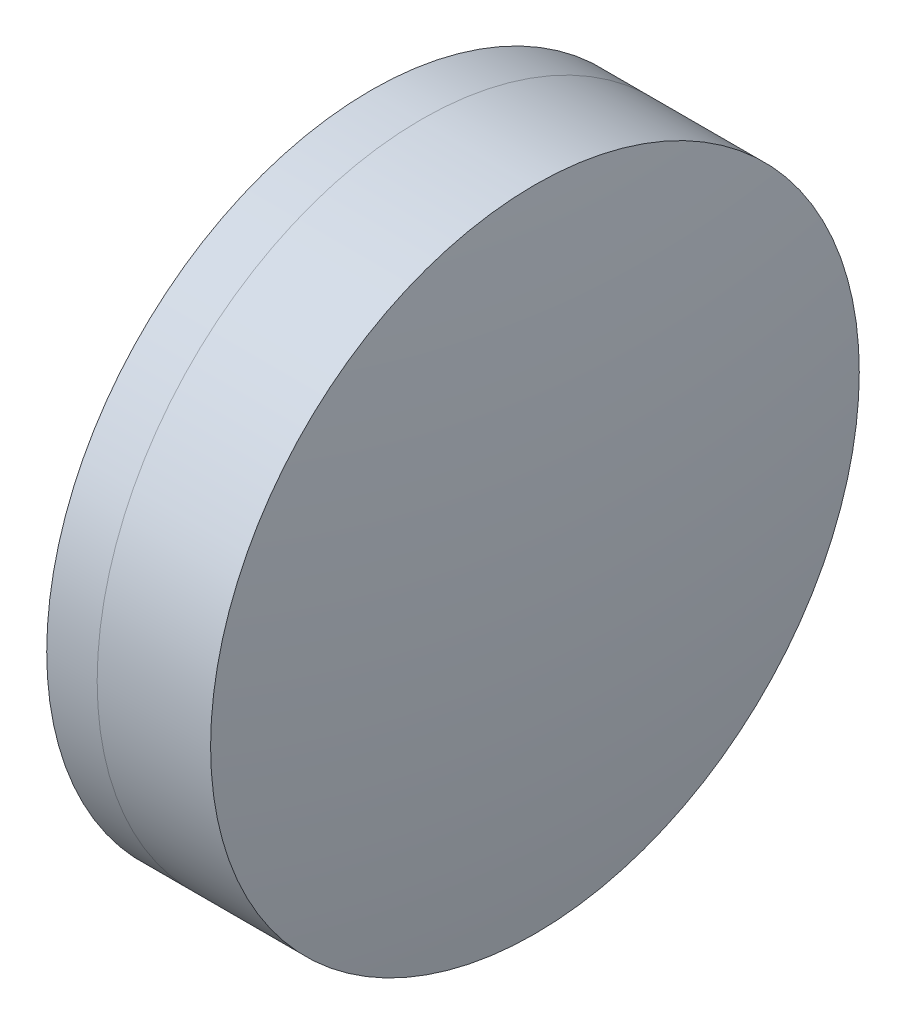
ISO-10303-21;
HEADER;
FILE_DESCRIPTION(('STEP AP214'),'2;1');
FILE_NAME('part.step','',(''),(''),'','','');
FILE_SCHEMA(('AUTOMOTIVE_DESIGN { 1 0 10303 214 1 1 1 1 }'));
ENDSEC;
DATA;
#1=APPLICATION_CONTEXT('core data for automotive mechanical design processes');
#2=APPLICATION_PROTOCOL_DEFINITION('international standard','automotive_design',2000,#1);
#3=PRODUCT_CONTEXT('',#1,'mechanical');
#4=PRODUCT('Part','Part','',(#3));
#5=PRODUCT_RELATED_PRODUCT_CATEGORY('part','',(#4));
#6=PRODUCT_DEFINITION_FORMATION('','',#4);
#7=PRODUCT_DEFINITION_CONTEXT('part definition',#1,'design');
#8=PRODUCT_DEFINITION('design','',#6,#7);
#9=PRODUCT_DEFINITION_SHAPE('','',#8);
#10=(LENGTH_UNIT() NAMED_UNIT(*) SI_UNIT(.MILLI.,.METRE.));
#11=(NAMED_UNIT(*) PLANE_ANGLE_UNIT() SI_UNIT($,.RADIAN.));
#12=(NAMED_UNIT(*) SI_UNIT($,.STERADIAN.) SOLID_ANGLE_UNIT());
#13=UNCERTAINTY_MEASURE_WITH_UNIT(LENGTH_MEASURE(1.E-05),#10,'distance_accuracy_value','');
#14=(GEOMETRIC_REPRESENTATION_CONTEXT(3) GLOBAL_UNCERTAINTY_ASSIGNED_CONTEXT((#13)) GLOBAL_UNIT_ASSIGNED_CONTEXT((#10,
#11,#12)) REPRESENTATION_CONTEXT('',''));
#15=CARTESIAN_POINT('',(0.,0.,0.));
#16=DIRECTION('',(0.,0.,1.));
#17=DIRECTION('',(1.,0.,0.));
#18=AXIS2_PLACEMENT_3D('',#15,#16,#17);
#19=CARTESIAN_POINT('',(14.8796689735747,0.,0.));
#20=DIRECTION('',(-1.,0.,0.));
#21=DIRECTION('',(0.,0.,1.));
#22=AXIS2_PLACEMENT_3D('',#19,#20,#21);
#23=SPHERICAL_SURFACE('',#22,29.466);
#24=CARTESIAN_POINT('',(41.5629063333855,0.,0.));
#25=DIRECTION('',(-1.,0.,0.));
#26=DIRECTION('',(0.,0.,1.));
#27=AXIS2_PLACEMENT_3D('',#24,#25,#26);
#28=CIRCLE('',#27,12.5);
#29=CARTESIAN_POINT('',(41.5629063333855,0.,12.5));
#30=VERTEX_POINT('',#29);
#31=EDGE_CURVE('E11',#30,#30,#28,.T.);
#32=ORIENTED_EDGE('',*,*,#31,.T.);
#33=EDGE_LOOP('',(#32));
#34=FACE_BOUND('',#33,.T.);
#35=ADVANCED_FACE('F45',(#34),#23,.F.);
#36=CARTESIAN_POINT('',(-0.551919992657797,0.,0.));
#37=DIRECTION('',(-1.,0.,0.));
#38=DIRECTION('',(0.,0.,1.));
#39=AXIS2_PLACEMENT_3D('',#36,#37,#38);
#40=CYLINDRICAL_SURFACE('',#39,12.5);
#41=CARTESIAN_POINT('',(45.9338354521669,0.,0.));
#42=DIRECTION('',(-1.,0.,0.));
#43=DIRECTION('',(0.,0.,1.));
#44=AXIS2_PLACEMENT_3D('',#41,#42,#43);
#45=CIRCLE('',#44,12.5);
#46=CARTESIAN_POINT('',(45.9338354521669,0.,12.5));
#47=VERTEX_POINT('',#46);
#48=EDGE_CURVE('E51',#47,#47,#45,.T.);
#49=ORIENTED_EDGE('',*,*,#48,.T.);
#50=EDGE_LOOP('',(#49));
#51=FACE_BOUND('',#50,.T.);
#52=ORIENTED_EDGE('',*,*,#31,.F.);
#53=EDGE_LOOP('',(#52));
#54=FACE_BOUND('',#53,.T.);
#55=ADVANCED_FACE('F57',(#51,#54),#40,.T.);
#56=CARTESIAN_POINT('',(-37.4403310264252,0.,0.));
#57=DIRECTION('',(-1.,0.,0.));
#58=DIRECTION('',(0.,0.,1.));
#59=AXIS2_PLACEMENT_3D('',#56,#57,#58);
#60=SPHERICAL_SURFACE('',#59,84.306);
#61=ORIENTED_EDGE('',*,*,#48,.F.);
#62=EDGE_LOOP('',(#61));
#63=FACE_BOUND('',#62,.T.);
#64=ADVANCED_FACE('F60',(#63),#60,.T.);
#65=CLOSED_SHELL('',(#35,#55,#64));
#66=MANIFOLD_SOLID_BREP('B2',#65);
#67=CARTESIAN_POINT('',(78.4376689735747,0.,0.));
#68=DIRECTION('',(-1.,0.,0.));
#69=DIRECTION('',(0.,0.,-1.));
#70=AXIS2_PLACEMENT_3D('',#67,#68,#69);
#71=SPHERICAL_SURFACE('',#70,40.782);
#72=CARTESIAN_POINT('',(39.6185818642673,0.,0.));
#73=DIRECTION('',(-1.,0.,0.));
#74=DIRECTION('',(0.,0.,1.));
#75=AXIS2_PLACEMENT_3D('',#72,#73,#74);
#76=CIRCLE('',#75,12.5);
#77=CARTESIAN_POINT('',(39.6185818642673,0.,12.5));
#78=VERTEX_POINT('',#77);
#79=EDGE_CURVE('E44',#78,#78,#76,.T.);
#80=ORIENTED_EDGE('',*,*,#79,.T.);
#81=EDGE_LOOP('',(#80));
#82=FACE_BOUND('',#81,.T.);
#83=ADVANCED_FACE('F86',(#82),#71,.T.);
#84=CARTESIAN_POINT('',(-9.70261217833668,0.,0.));
#85=DIRECTION('',(-1.,0.,0.));
#86=DIRECTION('',(0.,0.,1.));
#87=AXIS2_PLACEMENT_3D('',#84,#85,#86);
#88=CYLINDRICAL_SURFACE('',#87,12.5);
#89=CARTESIAN_POINT('',(41.5629063333855,0.,0.));
#90=DIRECTION('',(-1.,0.,0.));
#91=DIRECTION('',(0.,0.,1.));
#92=AXIS2_PLACEMENT_3D('',#89,#90,#91);
#93=CIRCLE('',#92,12.5);
#94=CARTESIAN_POINT('',(41.5629063333855,0.,12.5));
#95=VERTEX_POINT('',#94);
#96=EDGE_CURVE('E92',#95,#95,#93,.T.);
#97=ORIENTED_EDGE('',*,*,#96,.T.);
#98=EDGE_LOOP('',(#97));
#99=FACE_BOUND('',#98,.T.);
#100=ORIENTED_EDGE('',*,*,#79,.F.);
#101=EDGE_LOOP('',(#100));
#102=FACE_BOUND('',#101,.T.);
#103=ADVANCED_FACE('F98',(#99,#102),#88,.T.);
#104=CARTESIAN_POINT('',(14.8796689735747,0.,0.));
#105=DIRECTION('',(-1.,0.,0.));
#106=DIRECTION('',(0.,0.,1.));
#107=AXIS2_PLACEMENT_3D('',#104,#105,#106);
#108=SPHERICAL_SURFACE('',#107,29.466);
#109=ORIENTED_EDGE('',*,*,#96,.F.);
#110=EDGE_LOOP('',(#109));
#111=FACE_BOUND('',#110,.T.);
#112=ADVANCED_FACE('F101',(#111),#108,.T.);
#113=CLOSED_SHELL('',(#83,#103,#112));
#114=MANIFOLD_SOLID_BREP('B6',#113);
#115=ADVANCED_BREP_SHAPE_REPRESENTATION('',(#18,#66,#114),#14);
#116=SHAPE_DEFINITION_REPRESENTATION(#9,#115);
ENDSEC;
END-ISO-10303-21;
